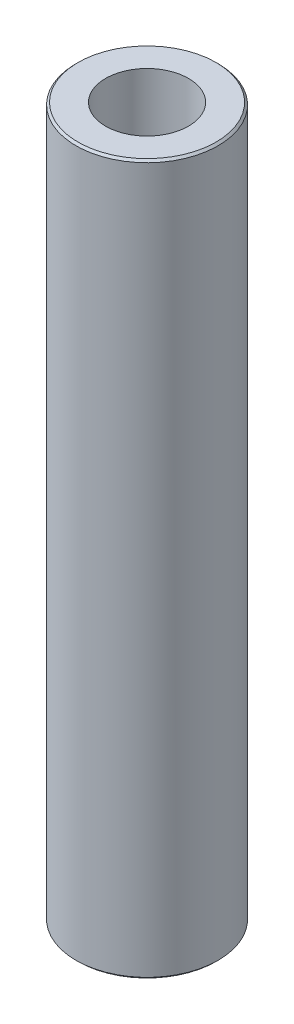
ISO-10303-21;
HEADER;
FILE_DESCRIPTION(('STEP AP214'),'2;1');
FILE_NAME('part.step','',(''),(''),'','','');
FILE_SCHEMA(('AUTOMOTIVE_DESIGN { 1 0 10303 214 1 1 1 1 }'));
ENDSEC;
DATA;
#1=APPLICATION_CONTEXT('core data for automotive mechanical design processes');
#2=APPLICATION_PROTOCOL_DEFINITION('international standard','automotive_design',2000,#1);
#3=PRODUCT_CONTEXT('',#1,'mechanical');
#4=PRODUCT('Part','Part','',(#3));
#5=PRODUCT_RELATED_PRODUCT_CATEGORY('part','',(#4));
#6=PRODUCT_DEFINITION_FORMATION('','',#4);
#7=PRODUCT_DEFINITION_CONTEXT('part definition',#1,'design');
#8=PRODUCT_DEFINITION('design','',#6,#7);
#9=PRODUCT_DEFINITION_SHAPE('','',#8);
#10=(LENGTH_UNIT() NAMED_UNIT(*) SI_UNIT(.MILLI.,.METRE.));
#11=(NAMED_UNIT(*) PLANE_ANGLE_UNIT() SI_UNIT($,.RADIAN.));
#12=(NAMED_UNIT(*) SI_UNIT($,.STERADIAN.) SOLID_ANGLE_UNIT());
#13=UNCERTAINTY_MEASURE_WITH_UNIT(LENGTH_MEASURE(1.E-05),#10,'distance_accuracy_value','');
#14=(GEOMETRIC_REPRESENTATION_CONTEXT(3) GLOBAL_UNCERTAINTY_ASSIGNED_CONTEXT((#13)) GLOBAL_UNIT_ASSIGNED_CONTEXT((#10,
#11,#12)) REPRESENTATION_CONTEXT('',''));
#15=CARTESIAN_POINT('',(0.,0.,0.));
#16=DIRECTION('',(0.,0.,1.));
#17=DIRECTION('',(1.,0.,0.));
#18=AXIS2_PLACEMENT_3D('',#15,#16,#17);
#19=CARTESIAN_POINT('',(0.,274.511758602576,0.));
#20=DIRECTION('',(0.,-1.,0.));
#21=DIRECTION('',(0.,0.,-1.));
#22=AXIS2_PLACEMENT_3D('',#19,#20,#21);
#23=CYLINDRICAL_SURFACE('',#22,27.5);
#24=CARTESIAN_POINT('',(0.,273.695089672929,0.));
#25=DIRECTION('',(0.,1.,0.));
#26=DIRECTION('',(0.,0.,1.));
#27=AXIS2_PLACEMENT_3D('',#24,#25,#26);
#28=CIRCLE('',#27,27.5);
#29=CARTESIAN_POINT('',(0.,273.695089672928,-27.5));
#30=VERTEX_POINT('',#29);
#31=EDGE_CURVE('E50',#30,#30,#28,.F.);
#32=ORIENTED_EDGE('',*,*,#31,.T.);
#33=EDGE_LOOP('',(#32));
#34=FACE_BOUND('',#33,.T.);
#35=CARTESIAN_POINT('',(0.,0.805938585814348,0.));
#36=DIRECTION('',(0.,1.,0.));
#37=DIRECTION('',(0.,0.,1.));
#38=AXIS2_PLACEMENT_3D('',#35,#36,#37);
#39=CIRCLE('',#38,27.5);
#40=CARTESIAN_POINT('',(0.,0.805938585814348,27.5));
#41=VERTEX_POINT('',#40);
#42=EDGE_CURVE('E51',#41,#41,#39,.T.);
#43=ORIENTED_EDGE('',*,*,#42,.T.);
#44=EDGE_LOOP('',(#43));
#45=FACE_BOUND('',#44,.T.);
#46=ADVANCED_FACE('F39',(#34,#45),#23,.T.);
#47=CARTESIAN_POINT('',(0.,274.511758602576,0.));
#48=DIRECTION('',(0.,1.,0.));
#49=DIRECTION('',(0.,0.,1.));
#50=AXIS2_PLACEMENT_3D('',#47,#48,#49);
#51=PLANE('',#50);
#52=CARTESIAN_POINT('',(0.,274.511758602576,0.));
#53=DIRECTION('',(0.,1.,0.));
#54=DIRECTION('',(0.,0.,1.));
#55=AXIS2_PLACEMENT_3D('',#52,#53,#54);
#56=CIRCLE('',#55,26.6940614141856);
#57=CARTESIAN_POINT('',(0.,274.511758602576,-26.6940614141856));
#58=VERTEX_POINT('',#57);
#59=EDGE_CURVE('E54',#58,#58,#56,.T.);
#60=ORIENTED_EDGE('',*,*,#59,.T.);
#61=EDGE_LOOP('',(#60));
#62=FACE_BOUND('',#61,.T.);
#63=CARTESIAN_POINT('',(0.,274.511758602576,0.));
#64=DIRECTION('',(0.,1.,0.));
#65=DIRECTION('',(0.,0.,1.));
#66=AXIS2_PLACEMENT_3D('',#63,#64,#65);
#67=CIRCLE('',#66,16.0296658999203);
#68=CARTESIAN_POINT('',(0.,274.511758602576,16.0296658999203));
#69=VERTEX_POINT('',#68);
#70=EDGE_CURVE('E58',#69,#69,#67,.T.);
#71=ORIENTED_EDGE('',*,*,#70,.F.);
#72=EDGE_LOOP('',(#71));
#73=FACE_BOUND('',#72,.T.);
#74=ADVANCED_FACE('F69',(#62,#73),#51,.T.);
#75=CARTESIAN_POINT('',(0.,0.,0.));
#76=DIRECTION('',(0.,1.,0.));
#77=DIRECTION('',(0.,0.,1.));
#78=AXIS2_PLACEMENT_3D('',#75,#76,#77);
#79=PLANE('',#78);
#80=CARTESIAN_POINT('',(0.,0.,0.));
#81=DIRECTION('',(0.,1.,0.));
#82=DIRECTION('',(0.,0.,1.));
#83=AXIS2_PLACEMENT_3D('',#80,#81,#82);
#84=CIRCLE('',#83,26.6833310703523);
#85=CARTESIAN_POINT('',(0.,0.,26.6833310703523));
#86=VERTEX_POINT('',#85);
#87=EDGE_CURVE('E10',#86,#86,#84,.F.);
#88=ORIENTED_EDGE('',*,*,#87,.T.);
#89=EDGE_LOOP('',(#88));
#90=FACE_BOUND('',#89,.T.);
#91=CARTESIAN_POINT('',(0.,0.,0.));
#92=DIRECTION('',(0.,1.,0.));
#93=DIRECTION('',(0.,0.,1.));
#94=AXIS2_PLACEMENT_3D('',#91,#92,#93);
#95=CIRCLE('',#94,16.0296658999203);
#96=CARTESIAN_POINT('',(0.,0.,16.0296658999203));
#97=VERTEX_POINT('',#96);
#98=EDGE_CURVE('E63',#97,#97,#95,.T.);
#99=ORIENTED_EDGE('',*,*,#98,.T.);
#100=EDGE_LOOP('',(#99));
#101=FACE_BOUND('',#100,.T.);
#102=ADVANCED_FACE('F75',(#90,#101),#79,.F.);
#103=CARTESIAN_POINT('',(0.,274.511758602576,0.));
#104=DIRECTION('',(0.,-1.,0.));
#105=DIRECTION('',(0.,0.,-1.));
#106=AXIS2_PLACEMENT_3D('',#103,#104,#105);
#107=CYLINDRICAL_SURFACE('',#106,16.0296658999203);
#108=ORIENTED_EDGE('',*,*,#70,.T.);
#109=EDGE_LOOP('',(#108));
#110=FACE_BOUND('',#109,.T.);
#111=ORIENTED_EDGE('',*,*,#98,.F.);
#112=EDGE_LOOP('',(#111));
#113=FACE_BOUND('',#112,.T.);
#114=ADVANCED_FACE('F70',(#110,#113),#107,.F.);
#115=CARTESIAN_POINT('',(0.,274.511758602576,0.));
#116=DIRECTION('',(0.,-1.,0.));
#117=DIRECTION('',(0.,0.,-1.));
#118=AXIS2_PLACEMENT_3D('',#115,#116,#117);
#119=CONICAL_SURFACE('',#118,26.6940614141856,0.77878523493809);
#120=CARTESIAN_POINT('',(0.,273.695089672928,-27.5));
#121=CARTESIAN_POINT('',(0.,273.703596640946,-27.4916048063978));
#122=CARTESIAN_POINT('',(0.,273.712103608963,-27.4832096127956));
#123=CARTESIAN_POINT('',(0.,273.729117544997,-27.4664192255911));
#124=CARTESIAN_POINT('',(0.,273.737624513014,-27.4580240319889));
#125=CARTESIAN_POINT('',(0.,273.754638449049,-27.4412336447844));
#126=CARTESIAN_POINT('',(0.,273.763145417066,-27.4328384511822));
#127=CARTESIAN_POINT('',(0.,273.7801593531,-27.4160480639777));
#128=CARTESIAN_POINT('',(0.,273.788666321117,-27.4076528703755));
#129=CARTESIAN_POINT('',(0.,273.805680257152,-27.390862483171));
#130=CARTESIAN_POINT('',(0.,273.814187225169,-27.3824672895688));
#131=CARTESIAN_POINT('',(0.,273.831201161203,-27.3656769023643));
#132=CARTESIAN_POINT('',(0.,273.83970812922,-27.3572817087621));
#133=CARTESIAN_POINT('',(0.,273.856722065255,-27.3404913215576));
#134=CARTESIAN_POINT('',(0.,273.865229033272,-27.3320961279554));
#135=CARTESIAN_POINT('',(0.,273.882242969306,-27.3153057407509));
#136=CARTESIAN_POINT('',(0.,273.890749937323,-27.3069105471487));
#137=CARTESIAN_POINT('',(0.,273.907763873358,-27.2901201599442));
#138=CARTESIAN_POINT('',(0.,273.916270841375,-27.281724966342));
#139=CARTESIAN_POINT('',(0.,273.933284777409,-27.2649345791375));
#140=CARTESIAN_POINT('',(0.,273.941791745426,-27.2565393855353));
#141=CARTESIAN_POINT('',(0.,273.958805681461,-27.2397489983308));
#142=CARTESIAN_POINT('',(0.,273.967312649478,-27.2313538047286));
#143=CARTESIAN_POINT('',(0.,273.984326585512,-27.2145634175241));
#144=CARTESIAN_POINT('',(0.,273.992833553529,-27.2061682239219));
#145=CARTESIAN_POINT('',(0.,274.009847489564,-27.1893778367174));
#146=CARTESIAN_POINT('',(0.,274.018354457581,-27.1809826431152));
#147=CARTESIAN_POINT('',(0.,274.035368393615,-27.1641922559107));
#148=CARTESIAN_POINT('',(0.,274.043875361632,-27.1557970623085));
#149=CARTESIAN_POINT('',(0.,274.060889297667,-27.139006675104));
#150=CARTESIAN_POINT('',(0.,274.069396265684,-27.1306114815018));
#151=CARTESIAN_POINT('',(0.,274.086410201718,-27.1138210942973));
#152=CARTESIAN_POINT('',(0.,274.094917169735,-27.1054259006951));
#153=CARTESIAN_POINT('',(0.,274.11193110577,-27.0886355134906));
#154=CARTESIAN_POINT('',(0.,274.120438073787,-27.0802403198884));
#155=CARTESIAN_POINT('',(0.,274.137452009821,-27.0634499326839));
#156=CARTESIAN_POINT('',(0.,274.145958977838,-27.0550547390817));
#157=CARTESIAN_POINT('',(0.,274.162972913873,-27.0382643518772));
#158=CARTESIAN_POINT('',(0.,274.17147988189,-27.029869158275));
#159=CARTESIAN_POINT('',(0.,274.188493817924,-27.0130787710705));
#160=CARTESIAN_POINT('',(0.,274.197000785941,-27.0046835774683));
#161=CARTESIAN_POINT('',(0.,274.214014721976,-26.9878931902638));
#162=CARTESIAN_POINT('',(0.,274.222521689993,-26.9794979966616));
#163=CARTESIAN_POINT('',(0.,274.239535626027,-26.9627076094571));
#164=CARTESIAN_POINT('',(0.,274.248042594044,-26.9543124158549));
#165=CARTESIAN_POINT('',(0.,274.265056530079,-26.9375220286504));
#166=CARTESIAN_POINT('',(0.,274.273563498096,-26.9291268350482));
#167=CARTESIAN_POINT('',(0.,274.29057743413,-26.9123364478437));
#168=CARTESIAN_POINT('',(0.,274.299084402147,-26.9039412542415));
#169=CARTESIAN_POINT('',(0.,274.316098338182,-26.887150867037));
#170=CARTESIAN_POINT('',(0.,274.324605306199,-26.8787556734348));
#171=CARTESIAN_POINT('',(0.,274.341619242233,-26.8619652862303));
#172=CARTESIAN_POINT('',(0.,274.35012621025,-26.8535700926281));
#173=CARTESIAN_POINT('',(0.,274.367140146285,-26.8367797054236));
#174=CARTESIAN_POINT('',(0.,274.375647114302,-26.8283845118214));
#175=CARTESIAN_POINT('',(0.,274.392661050336,-26.8115941246169));
#176=CARTESIAN_POINT('',(0.,274.401168018353,-26.8031989310147));
#177=CARTESIAN_POINT('',(0.,274.418181954388,-26.7864085438102));
#178=CARTESIAN_POINT('',(0.,274.426688922405,-26.778013350208));
#179=CARTESIAN_POINT('',(0.,274.443702858439,-26.7612229630035));
#180=CARTESIAN_POINT('',(0.,274.452209826456,-26.7528277694013));
#181=CARTESIAN_POINT('',(0.,274.469223762491,-26.7360373821968));
#182=CARTESIAN_POINT('',(0.,274.477730730508,-26.7276421885946));
#183=CARTESIAN_POINT('',(0.,274.494744666542,-26.7108518013901));
#184=CARTESIAN_POINT('',(0.,274.503251634559,-26.7024566077879));
#185=CARTESIAN_POINT('',(0.,274.511758602576,-26.6940614141856));
#186=B_SPLINE_CURVE_WITH_KNOTS('',3,(#120,#121,#122,#123,#124,#125,#126,#127,#128,#129,#130,
#131,#132,#133,#134,#135,#136,#137,#138,#139,#140,#141,#142,#143,#144,#145,#146,#147,#148,#149,
#150,#151,#152,#153,#154,#155,#156,#157,#158,#159,#160,#161,#162,#163,#164,#165,#166,#167,#168,
#169,#170,#171,#172,#173,#174,#175,#176,#177,#178,#179,#180,#181,#182,#183,#184,#185),
.UNSPECIFIED.,.F.,.F.,(4,2,2,2,2,2,2,2,2,2,2,2,2,2,2,2,2,2,2,2,2,2,2,2,2,2,2,2,2,2,2,2,4),(0.,
0.0358556832897778,0.0717113665795531,0.107567049869331,0.143422733159106,0.179278416448884,
0.215134099738659,0.250989783028437,0.286845466318175,0.322701149607951,0.358556832897729,
0.394412516187504,0.430268199477282,0.466123882767057,0.501979566056835,0.53783524934661,
0.573690932636348,0.609546615926126,0.645402299215902,0.681257982505679,0.717113665795455,
0.752969349085232,0.788825032375008,0.824680715664785,0.860536398954563,0.896392082244299,
0.932247765534077,0.968103448823852,1.00395913211363,1.03981481540341,1.07567049869318,
1.11152618198296,1.14738186527274),.UNSPECIFIED.);
#187=EDGE_CURVE('BSEAM81',#30,#58,#186,.T.);
#188=ORIENTED_EDGE('',*,*,#31,.F.);
#189=ORIENTED_EDGE('',*,*,#59,.F.);
#190=ORIENTED_EDGE('',*,*,#187,.T.);
#191=ORIENTED_EDGE('',*,*,#187,.F.);
#192=EDGE_LOOP('',(#188,#190,#189,#191));
#193=FACE_BOUND('',#192,.T.);
#194=ADVANCED_FACE('F81',(#193),#119,.T.);
#195=CARTESIAN_POINT('',(0.,0.805938585814348,0.));
#196=DIRECTION('',(0.,1.,0.));
#197=DIRECTION('',(0.,0.,1.));
#198=AXIS2_PLACEMENT_3D('',#195,#196,#197);
#199=CONICAL_SURFACE('',#198,27.5,0.792011091856799);
#200=ORIENTED_EDGE('',*,*,#87,.F.);
#201=EDGE_LOOP('',(#200));
#202=FACE_BOUND('',#201,.T.);
#203=ORIENTED_EDGE('',*,*,#42,.F.);
#204=EDGE_LOOP('',(#203));
#205=FACE_BOUND('',#204,.T.);
#206=ADVANCED_FACE('F45',(#202,#205),#199,.T.);
#207=CLOSED_SHELL('',(#46,#74,#102,#114,#194,#206));
#208=MANIFOLD_SOLID_BREP('B2',#207);
#209=ADVANCED_BREP_SHAPE_REPRESENTATION('',(#18,#208),#14);
#210=SHAPE_DEFINITION_REPRESENTATION(#9,#209);
ENDSEC;
END-ISO-10303-21;
